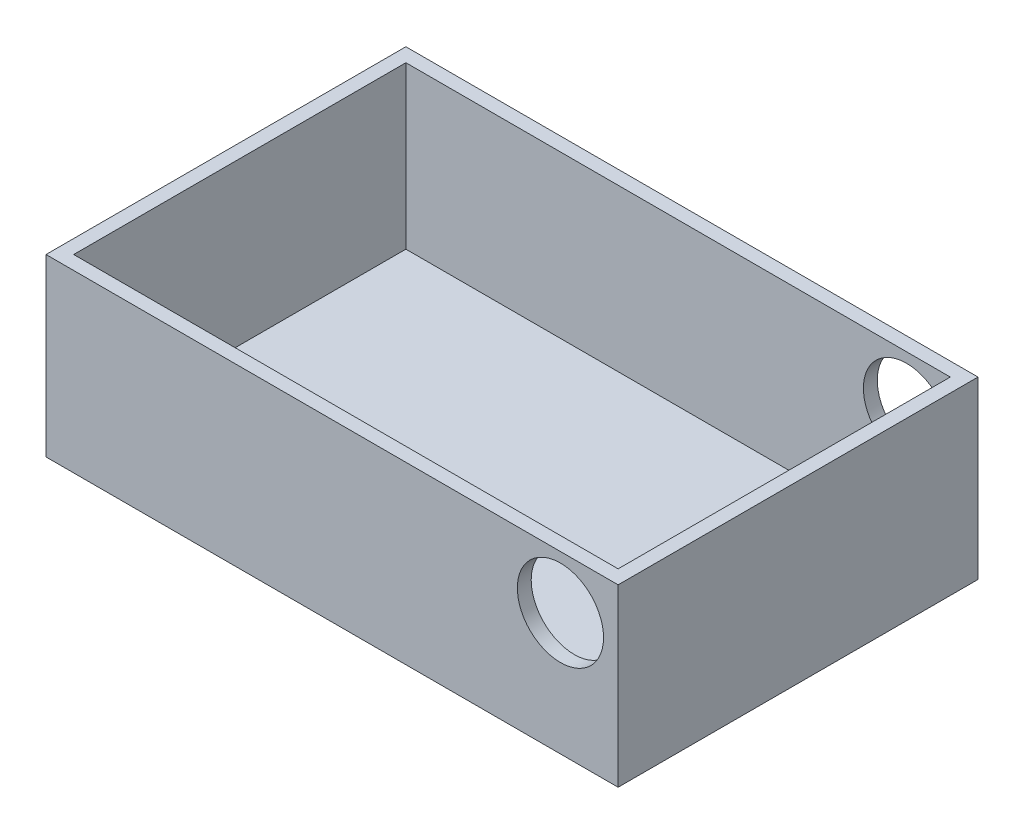
ISO-10303-21;
HEADER;
FILE_DESCRIPTION(('STEP AP214'),'2;1');
FILE_NAME('part.step','',(''),(''),'','','');
FILE_SCHEMA(('AUTOMOTIVE_DESIGN { 1 0 10303 214 1 1 1 1 }'));
ENDSEC;
DATA;
#1=APPLICATION_CONTEXT('core data for automotive mechanical design processes');
#2=APPLICATION_PROTOCOL_DEFINITION('international standard','automotive_design',2000,#1);
#3=PRODUCT_CONTEXT('',#1,'mechanical');
#4=PRODUCT('Part','Part','',(#3));
#5=PRODUCT_RELATED_PRODUCT_CATEGORY('part','',(#4));
#6=PRODUCT_DEFINITION_FORMATION('','',#4);
#7=PRODUCT_DEFINITION_CONTEXT('part definition',#1,'design');
#8=PRODUCT_DEFINITION('design','',#6,#7);
#9=PRODUCT_DEFINITION_SHAPE('','',#8);
#10=(LENGTH_UNIT() NAMED_UNIT(*) SI_UNIT(.MILLI.,.METRE.));
#11=(NAMED_UNIT(*) PLANE_ANGLE_UNIT() SI_UNIT($,.RADIAN.));
#12=(NAMED_UNIT(*) SI_UNIT($,.STERADIAN.) SOLID_ANGLE_UNIT());
#13=UNCERTAINTY_MEASURE_WITH_UNIT(LENGTH_MEASURE(1.E-05),#10,'distance_accuracy_value','');
#14=(GEOMETRIC_REPRESENTATION_CONTEXT(3) GLOBAL_UNCERTAINTY_ASSIGNED_CONTEXT((#13)) GLOBAL_UNIT_ASSIGNED_CONTEXT((#10,
#11,#12)) REPRESENTATION_CONTEXT('',''));
#15=CARTESIAN_POINT('',(0.,0.,0.));
#16=DIRECTION('',(0.,0.,1.));
#17=DIRECTION('',(1.,0.,0.));
#18=AXIS2_PLACEMENT_3D('',#15,#16,#17);
#19=CARTESIAN_POINT('',(0.,241.3,0.));
#20=DIRECTION('',(0.,-1.,0.));
#21=DIRECTION('',(0.,0.,-1.));
#22=AXIS2_PLACEMENT_3D('',#19,#20,#21);
#23=PLANE('',#22);
#24=DIRECTION('',(0.,0.,1.));
#25=VECTOR('',#24,1.);
#26=CARTESIAN_POINT('',(0.,241.3,0.));
#27=LINE('',#26,#25);
#28=CARTESIAN_POINT('',(0.,241.3,-495.3));
#29=VERTEX_POINT('',#28);
#30=CARTESIAN_POINT('',(0.,241.3,0.));
#31=VERTEX_POINT('',#30);
#32=EDGE_CURVE('E161',#29,#31,#27,.T.);
#33=ORIENTED_EDGE('',*,*,#32,.T.);
#34=DIRECTION('',(1.,0.,0.));
#35=VECTOR('',#34,1.);
#36=CARTESIAN_POINT('',(0.,241.3,0.));
#37=LINE('',#36,#35);
#38=CARTESIAN_POINT('',(787.4,241.3,0.));
#39=VERTEX_POINT('',#38);
#40=EDGE_CURVE('E105',#31,#39,#37,.T.);
#41=ORIENTED_EDGE('',*,*,#40,.T.);
#42=DIRECTION('',(0.,0.,-1.));
#43=VECTOR('',#42,1.);
#44=CARTESIAN_POINT('',(787.4,241.3,0.));
#45=LINE('',#44,#43);
#46=CARTESIAN_POINT('',(787.4,241.3,-495.3));
#47=VERTEX_POINT('',#46);
#48=EDGE_CURVE('E164',#39,#47,#45,.T.);
#49=ORIENTED_EDGE('',*,*,#48,.T.);
#50=DIRECTION('',(-1.,0.,0.));
#51=VECTOR('',#50,1.);
#52=CARTESIAN_POINT('',(0.,241.3,-495.3));
#53=LINE('',#52,#51);
#54=EDGE_CURVE('E77',#47,#29,#53,.T.);
#55=ORIENTED_EDGE('',*,*,#54,.T.);
#56=EDGE_LOOP('',(#33,#41,#49,#55));
#57=FACE_BOUND('',#56,.T.);
#58=DIRECTION('',(0.,0.,1.));
#59=VECTOR('',#58,1.);
#60=CARTESIAN_POINT('',(19.05,241.3,0.));
#61=LINE('',#60,#59);
#62=CARTESIAN_POINT('',(19.05,241.3,-476.25));
#63=VERTEX_POINT('',#62);
#64=CARTESIAN_POINT('',(19.05,241.3,-19.05));
#65=VERTEX_POINT('',#64);
#66=EDGE_CURVE('E150',#63,#65,#61,.T.);
#67=ORIENTED_EDGE('',*,*,#66,.F.);
#68=DIRECTION('',(-1.,0.,0.));
#69=VECTOR('',#68,1.);
#70=CARTESIAN_POINT('',(0.,241.3,-476.25));
#71=LINE('',#70,#69);
#72=CARTESIAN_POINT('',(768.35,241.3,-476.25));
#73=VERTEX_POINT('',#72);
#74=EDGE_CURVE('E159',#73,#63,#71,.T.);
#75=ORIENTED_EDGE('',*,*,#74,.F.);
#76=DIRECTION('',(0.,0.,-1.));
#77=VECTOR('',#76,1.);
#78=CARTESIAN_POINT('',(768.35,241.3,2.22044604925031E-13));
#79=LINE('',#78,#77);
#80=CARTESIAN_POINT('',(768.35,241.3,-19.05));
#81=VERTEX_POINT('',#80);
#82=EDGE_CURVE('E157',#81,#73,#79,.T.);
#83=ORIENTED_EDGE('',*,*,#82,.F.);
#84=DIRECTION('',(1.,0.,0.));
#85=VECTOR('',#84,1.);
#86=CARTESIAN_POINT('',(0.,241.3,-19.05));
#87=LINE('',#86,#85);
#88=EDGE_CURVE('E142',#65,#81,#87,.T.);
#89=ORIENTED_EDGE('',*,*,#88,.F.);
#90=EDGE_LOOP('',(#67,#75,#83,#89));
#91=FACE_BOUND('',#90,.T.);
#92=ADVANCED_FACE('F52',(#57,#91),#23,.F.);
#93=CARTESIAN_POINT('',(0.,241.3,0.));
#94=DIRECTION('',(1.,0.,0.));
#95=DIRECTION('',(0.,0.,-1.));
#96=AXIS2_PLACEMENT_3D('',#93,#94,#95);
#97=PLANE('',#96);
#98=DIRECTION('',(0.,0.,1.));
#99=VECTOR('',#98,1.);
#100=CARTESIAN_POINT('',(0.,0.,0.));
#101=LINE('',#100,#99);
#102=CARTESIAN_POINT('',(0.,0.,-495.3));
#103=VERTEX_POINT('',#102);
#104=CARTESIAN_POINT('',(0.,0.,0.));
#105=VERTEX_POINT('',#104);
#106=EDGE_CURVE('E168',#103,#105,#101,.T.);
#107=ORIENTED_EDGE('',*,*,#106,.T.);
#108=DIRECTION('',(0.,-1.,0.));
#109=VECTOR('',#108,1.);
#110=CARTESIAN_POINT('',(0.,241.3,0.));
#111=LINE('',#110,#109);
#112=EDGE_CURVE('E13',#31,#105,#111,.T.);
#113=ORIENTED_EDGE('',*,*,#112,.F.);
#114=ORIENTED_EDGE('',*,*,#32,.F.);
#115=DIRECTION('',(0.,-1.,0.));
#116=VECTOR('',#115,1.);
#117=CARTESIAN_POINT('',(0.,241.3,-495.3));
#118=LINE('',#117,#116);
#119=EDGE_CURVE('E167',#29,#103,#118,.T.);
#120=ORIENTED_EDGE('',*,*,#119,.T.);
#121=EDGE_LOOP('',(#107,#113,#114,#120));
#122=FACE_BOUND('',#121,.T.);
#123=ADVANCED_FACE('F54',(#122),#97,.F.);
#124=CARTESIAN_POINT('',(0.,241.3,0.));
#125=DIRECTION('',(0.,0.,-1.));
#126=DIRECTION('',(-1.,0.,0.));
#127=AXIS2_PLACEMENT_3D('',#124,#125,#126);
#128=PLANE('',#127);
#129=CARTESIAN_POINT('',(708.025,168.275,0.));
#130=DIRECTION('',(0.,0.,1.));
#131=DIRECTION('',(1.,0.,0.));
#132=AXIS2_PLACEMENT_3D('',#129,#130,#131);
#133=CIRCLE('',#132,59.309);
#134=CARTESIAN_POINT('',(767.334,168.275,0.));
#135=VERTEX_POINT('',#134);
#136=EDGE_CURVE('E238',#135,#135,#133,.T.);
#137=ORIENTED_EDGE('',*,*,#136,.F.);
#138=EDGE_LOOP('',(#137));
#139=FACE_BOUND('',#138,.T.);
#140=DIRECTION('',(1.,0.,0.));
#141=VECTOR('',#140,1.);
#142=CARTESIAN_POINT('',(0.,0.,0.));
#143=LINE('',#142,#141);
#144=CARTESIAN_POINT('',(787.4,0.,0.));
#145=VERTEX_POINT('',#144);
#146=EDGE_CURVE('E171',#105,#145,#143,.T.);
#147=ORIENTED_EDGE('',*,*,#146,.T.);
#148=DIRECTION('',(0.,-1.,0.));
#149=VECTOR('',#148,1.);
#150=CARTESIAN_POINT('',(787.4,241.3,0.));
#151=LINE('',#150,#149);
#152=EDGE_CURVE('E61',#39,#145,#151,.T.);
#153=ORIENTED_EDGE('',*,*,#152,.F.);
#154=ORIENTED_EDGE('',*,*,#40,.F.);
#155=ORIENTED_EDGE('',*,*,#112,.T.);
#156=EDGE_LOOP('',(#147,#153,#154,#155));
#157=FACE_BOUND('',#156,.T.);
#158=ADVANCED_FACE('F201',(#139,#157),#128,.F.);
#159=CARTESIAN_POINT('',(787.4,241.3,0.));
#160=DIRECTION('',(-1.,0.,0.));
#161=DIRECTION('',(0.,0.,1.));
#162=AXIS2_PLACEMENT_3D('',#159,#160,#161);
#163=PLANE('',#162);
#164=DIRECTION('',(0.,0.,-1.));
#165=VECTOR('',#164,1.);
#166=CARTESIAN_POINT('',(787.4,0.,0.));
#167=LINE('',#166,#165);
#168=CARTESIAN_POINT('',(787.4,0.,-495.3));
#169=VERTEX_POINT('',#168);
#170=EDGE_CURVE('E173',#145,#169,#167,.T.);
#171=ORIENTED_EDGE('',*,*,#170,.T.);
#172=DIRECTION('',(0.,-1.,0.));
#173=VECTOR('',#172,1.);
#174=CARTESIAN_POINT('',(787.4,241.3,-495.3));
#175=LINE('',#174,#173);
#176=EDGE_CURVE('E177',#47,#169,#175,.T.);
#177=ORIENTED_EDGE('',*,*,#176,.F.);
#178=ORIENTED_EDGE('',*,*,#48,.F.);
#179=ORIENTED_EDGE('',*,*,#152,.T.);
#180=EDGE_LOOP('',(#171,#177,#178,#179));
#181=FACE_BOUND('',#180,.T.);
#182=ADVANCED_FACE('F183',(#181),#163,.F.);
#183=CARTESIAN_POINT('',(0.,241.3,-495.3));
#184=DIRECTION('',(0.,0.,1.));
#185=DIRECTION('',(1.,0.,0.));
#186=AXIS2_PLACEMENT_3D('',#183,#184,#185);
#187=PLANE('',#186);
#188=CARTESIAN_POINT('',(708.025,168.275,-495.3));
#189=DIRECTION('',(0.,0.,1.));
#190=DIRECTION('',(1.,0.,0.));
#191=AXIS2_PLACEMENT_3D('',#188,#189,#190);
#192=CIRCLE('',#191,59.309);
#193=CARTESIAN_POINT('',(767.334,168.275,-495.3));
#194=VERTEX_POINT('',#193);
#195=EDGE_CURVE('E237',#194,#194,#192,.T.);
#196=ORIENTED_EDGE('',*,*,#195,.T.);
#197=EDGE_LOOP('',(#196));
#198=FACE_BOUND('',#197,.T.);
#199=DIRECTION('',(-1.,0.,0.));
#200=VECTOR('',#199,1.);
#201=CARTESIAN_POINT('',(0.,0.,-495.3));
#202=LINE('',#201,#200);
#203=EDGE_CURVE('E98',#169,#103,#202,.T.);
#204=ORIENTED_EDGE('',*,*,#203,.T.);
#205=ORIENTED_EDGE('',*,*,#119,.F.);
#206=ORIENTED_EDGE('',*,*,#54,.F.);
#207=ORIENTED_EDGE('',*,*,#176,.T.);
#208=EDGE_LOOP('',(#204,#205,#206,#207));
#209=FACE_BOUND('',#208,.T.);
#210=ADVANCED_FACE('F191',(#198,#209),#187,.F.);
#211=CARTESIAN_POINT('',(0.,0.,0.));
#212=DIRECTION('',(0.,-1.,0.));
#213=DIRECTION('',(0.,0.,-1.));
#214=AXIS2_PLACEMENT_3D('',#211,#212,#213);
#215=PLANE('',#214);
#216=ORIENTED_EDGE('',*,*,#106,.F.);
#217=ORIENTED_EDGE('',*,*,#203,.F.);
#218=ORIENTED_EDGE('',*,*,#170,.F.);
#219=ORIENTED_EDGE('',*,*,#146,.F.);
#220=EDGE_LOOP('',(#216,#217,#218,#219));
#221=FACE_BOUND('',#220,.T.);
#222=ADVANCED_FACE('F187',(#221),#215,.T.);
#223=CARTESIAN_POINT('',(19.05,241.3,0.));
#224=DIRECTION('',(1.,0.,0.));
#225=DIRECTION('',(0.,0.,-1.));
#226=AXIS2_PLACEMENT_3D('',#223,#224,#225);
#227=PLANE('',#226);
#228=DIRECTION('',(0.,0.,1.));
#229=VECTOR('',#228,1.);
#230=CARTESIAN_POINT('',(19.05,19.05,0.));
#231=LINE('',#230,#229);
#232=CARTESIAN_POINT('',(19.05,19.05,-476.25));
#233=VERTEX_POINT('',#232);
#234=CARTESIAN_POINT('',(19.05,19.05,-19.05));
#235=VERTEX_POINT('',#234);
#236=EDGE_CURVE('E133',#233,#235,#231,.T.);
#237=ORIENTED_EDGE('',*,*,#236,.F.);
#238=DIRECTION('',(0.,-1.,0.));
#239=VECTOR('',#238,1.);
#240=CARTESIAN_POINT('',(19.05,241.3,-476.25));
#241=LINE('',#240,#239);
#242=EDGE_CURVE('E153',#63,#233,#241,.T.);
#243=ORIENTED_EDGE('',*,*,#242,.F.);
#244=ORIENTED_EDGE('',*,*,#66,.T.);
#245=DIRECTION('',(0.,-1.,0.));
#246=VECTOR('',#245,1.);
#247=CARTESIAN_POINT('',(19.05,241.3,-19.05));
#248=LINE('',#247,#246);
#249=EDGE_CURVE('E145',#65,#235,#248,.T.);
#250=ORIENTED_EDGE('',*,*,#249,.T.);
#251=EDGE_LOOP('',(#237,#243,#244,#250));
#252=FACE_BOUND('',#251,.T.);
#253=ADVANCED_FACE('F199',(#252),#227,.T.);
#254=CARTESIAN_POINT('',(0.,241.3,-19.05));
#255=DIRECTION('',(0.,0.,-1.));
#256=DIRECTION('',(-1.,0.,0.));
#257=AXIS2_PLACEMENT_3D('',#254,#255,#256);
#258=PLANE('',#257);
#259=CARTESIAN_POINT('',(708.025,168.275,-19.05));
#260=DIRECTION('',(0.,0.,-1.));
#261=DIRECTION('',(-1.,0.,0.));
#262=AXIS2_PLACEMENT_3D('',#259,#260,#261);
#263=CIRCLE('',#262,59.309);
#264=CARTESIAN_POINT('',(648.716,168.275,-19.05));
#265=VERTEX_POINT('',#264);
#266=EDGE_CURVE('E240',#265,#265,#263,.T.);
#267=ORIENTED_EDGE('',*,*,#266,.F.);
#268=EDGE_LOOP('',(#267));
#269=FACE_BOUND('',#268,.T.);
#270=DIRECTION('',(1.,0.,0.));
#271=VECTOR('',#270,1.);
#272=CARTESIAN_POINT('',(0.,19.05,-19.05));
#273=LINE('',#272,#271);
#274=CARTESIAN_POINT('',(768.35,19.05,-19.05));
#275=VERTEX_POINT('',#274);
#276=EDGE_CURVE('E127',#235,#275,#273,.T.);
#277=ORIENTED_EDGE('',*,*,#276,.F.);
#278=ORIENTED_EDGE('',*,*,#249,.F.);
#279=ORIENTED_EDGE('',*,*,#88,.T.);
#280=DIRECTION('',(0.,-1.,0.));
#281=VECTOR('',#280,1.);
#282=CARTESIAN_POINT('',(768.35,241.3,-19.05));
#283=LINE('',#282,#281);
#284=EDGE_CURVE('E139',#81,#275,#283,.T.);
#285=ORIENTED_EDGE('',*,*,#284,.T.);
#286=EDGE_LOOP('',(#277,#278,#279,#285));
#287=FACE_BOUND('',#286,.T.);
#288=ADVANCED_FACE('F140',(#269,#287),#258,.T.);
#289=CARTESIAN_POINT('',(768.35,241.3,0.));
#290=DIRECTION('',(-1.,0.,0.));
#291=DIRECTION('',(0.,0.,1.));
#292=AXIS2_PLACEMENT_3D('',#289,#290,#291);
#293=PLANE('',#292);
#294=DIRECTION('',(0.,0.,-1.));
#295=VECTOR('',#294,1.);
#296=CARTESIAN_POINT('',(768.35,19.05,2.22044604925031E-13));
#297=LINE('',#296,#295);
#298=CARTESIAN_POINT('',(768.35,19.05,-476.25));
#299=VERTEX_POINT('',#298);
#300=EDGE_CURVE('E131',#275,#299,#297,.T.);
#301=ORIENTED_EDGE('',*,*,#300,.F.);
#302=ORIENTED_EDGE('',*,*,#284,.F.);
#303=ORIENTED_EDGE('',*,*,#82,.T.);
#304=DIRECTION('',(0.,-1.,0.));
#305=VECTOR('',#304,1.);
#306=CARTESIAN_POINT('',(768.35,241.3,-476.25));
#307=LINE('',#306,#305);
#308=EDGE_CURVE('E68',#73,#299,#307,.T.);
#309=ORIENTED_EDGE('',*,*,#308,.T.);
#310=EDGE_LOOP('',(#301,#302,#303,#309));
#311=FACE_BOUND('',#310,.T.);
#312=ADVANCED_FACE('F147',(#311),#293,.T.);
#313=CARTESIAN_POINT('',(0.,241.3,-476.25));
#314=DIRECTION('',(0.,0.,1.));
#315=DIRECTION('',(1.,0.,0.));
#316=AXIS2_PLACEMENT_3D('',#313,#314,#315);
#317=PLANE('',#316);
#318=CARTESIAN_POINT('',(708.025,168.275,-476.25));
#319=DIRECTION('',(0.,0.,1.));
#320=DIRECTION('',(1.,0.,0.));
#321=AXIS2_PLACEMENT_3D('',#318,#319,#320);
#322=CIRCLE('',#321,59.309);
#323=CARTESIAN_POINT('',(767.334,168.275,-476.25));
#324=VERTEX_POINT('',#323);
#325=EDGE_CURVE('E56',#324,#324,#322,.T.);
#326=ORIENTED_EDGE('',*,*,#325,.F.);
#327=EDGE_LOOP('',(#326));
#328=FACE_BOUND('',#327,.T.);
#329=DIRECTION('',(-1.,0.,0.));
#330=VECTOR('',#329,1.);
#331=CARTESIAN_POINT('',(0.,19.05,-476.25));
#332=LINE('',#331,#330);
#333=EDGE_CURVE('E148',#299,#233,#332,.T.);
#334=ORIENTED_EDGE('',*,*,#333,.F.);
#335=ORIENTED_EDGE('',*,*,#308,.F.);
#336=ORIENTED_EDGE('',*,*,#74,.T.);
#337=ORIENTED_EDGE('',*,*,#242,.T.);
#338=EDGE_LOOP('',(#334,#335,#336,#337));
#339=FACE_BOUND('',#338,.T.);
#340=ADVANCED_FACE('F214',(#328,#339),#317,.T.);
#341=CARTESIAN_POINT('',(0.,19.05,0.));
#342=DIRECTION('',(0.,-1.,0.));
#343=DIRECTION('',(0.,0.,-1.));
#344=AXIS2_PLACEMENT_3D('',#341,#342,#343);
#345=PLANE('',#344);
#346=ORIENTED_EDGE('',*,*,#236,.T.);
#347=ORIENTED_EDGE('',*,*,#276,.T.);
#348=ORIENTED_EDGE('',*,*,#300,.T.);
#349=ORIENTED_EDGE('',*,*,#333,.T.);
#350=EDGE_LOOP('',(#346,#347,#348,#349));
#351=FACE_BOUND('',#350,.T.);
#352=ADVANCED_FACE('F129',(#351),#345,.F.);
#353=CARTESIAN_POINT('',(708.025,168.275,-495.3));
#354=DIRECTION('',(0.,0.,1.));
#355=DIRECTION('',(1.,0.,0.));
#356=AXIS2_PLACEMENT_3D('',#353,#354,#355);
#357=CYLINDRICAL_SURFACE('',#356,59.309);
#358=ORIENTED_EDGE('',*,*,#325,.T.);
#359=EDGE_LOOP('',(#358));
#360=FACE_BOUND('',#359,.T.);
#361=ORIENTED_EDGE('',*,*,#195,.F.);
#362=EDGE_LOOP('',(#361));
#363=FACE_BOUND('',#362,.T.);
#364=ADVANCED_FACE('F213',(#360,#363),#357,.F.);
#365=ORIENTED_EDGE('',*,*,#266,.T.);
#366=EDGE_LOOP('',(#365));
#367=FACE_BOUND('',#366,.T.);
#368=ORIENTED_EDGE('',*,*,#136,.T.);
#369=EDGE_LOOP('',(#368));
#370=FACE_BOUND('',#369,.T.);
#371=ADVANCED_FACE('F227',(#367,#370),#357,.F.);
#372=CLOSED_SHELL('',(#92,#123,#158,#182,#210,#222,#253,#288,#312,#340,#352,#364,#371));
#373=MANIFOLD_SOLID_BREP('B2',#372);
#374=ADVANCED_BREP_SHAPE_REPRESENTATION('',(#18,#373),#14);
#375=SHAPE_DEFINITION_REPRESENTATION(#9,#374);
ENDSEC;
END-ISO-10303-21;
